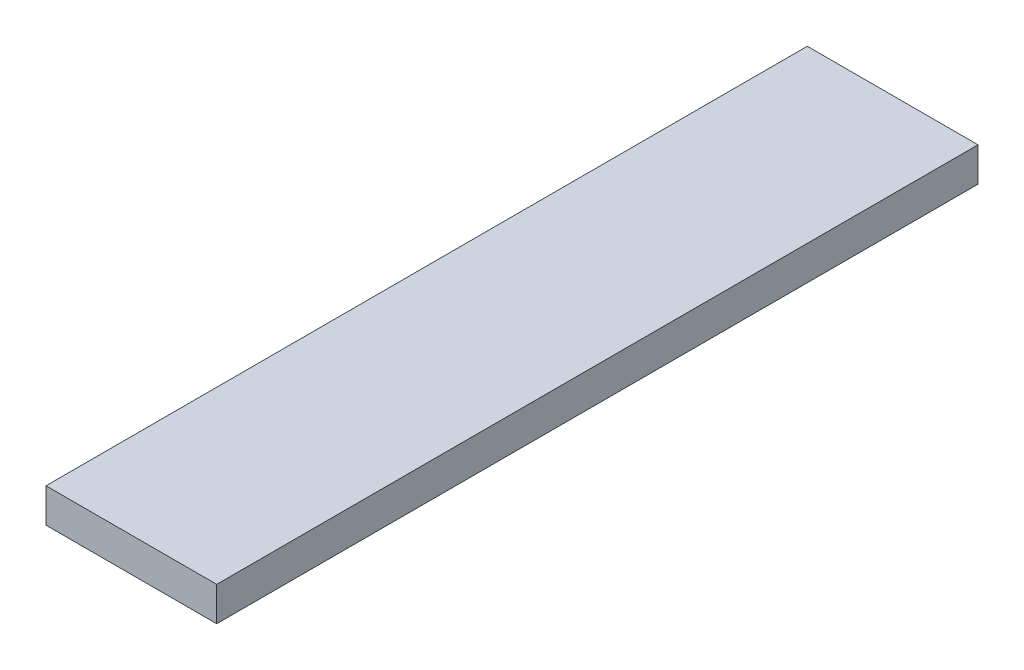
ISO-10303-21;
HEADER;
FILE_DESCRIPTION(('STEP AP214'),'2;1');
FILE_NAME('part.step','',(''),(''),'','','');
FILE_SCHEMA(('AUTOMOTIVE_DESIGN { 1 0 10303 214 1 1 1 1 }'));
ENDSEC;
DATA;
#1=APPLICATION_CONTEXT('core data for automotive mechanical design processes');
#2=APPLICATION_PROTOCOL_DEFINITION('international standard','automotive_design',2000,#1);
#3=PRODUCT_CONTEXT('',#1,'mechanical');
#4=PRODUCT('Part','Part','',(#3));
#5=PRODUCT_RELATED_PRODUCT_CATEGORY('part','',(#4));
#6=PRODUCT_DEFINITION_FORMATION('','',#4);
#7=PRODUCT_DEFINITION_CONTEXT('part definition',#1,'design');
#8=PRODUCT_DEFINITION('design','',#6,#7);
#9=PRODUCT_DEFINITION_SHAPE('','',#8);
#10=(LENGTH_UNIT() NAMED_UNIT(*) SI_UNIT(.MILLI.,.METRE.));
#11=(NAMED_UNIT(*) PLANE_ANGLE_UNIT() SI_UNIT($,.RADIAN.));
#12=(NAMED_UNIT(*) SI_UNIT($,.STERADIAN.) SOLID_ANGLE_UNIT());
#13=UNCERTAINTY_MEASURE_WITH_UNIT(LENGTH_MEASURE(1.E-05),#10,'distance_accuracy_value','');
#14=(GEOMETRIC_REPRESENTATION_CONTEXT(3) GLOBAL_UNCERTAINTY_ASSIGNED_CONTEXT((#13)) GLOBAL_UNIT_ASSIGNED_CONTEXT((#10,
#11,#12)) REPRESENTATION_CONTEXT('',''));
#15=CARTESIAN_POINT('',(0.,0.,0.));
#16=DIRECTION('',(0.,0.,1.));
#17=DIRECTION('',(1.,0.,0.));
#18=AXIS2_PLACEMENT_3D('',#15,#16,#17);
#19=CARTESIAN_POINT('',(0.,10.,0.));
#20=DIRECTION('',(0.,1.,0.));
#21=DIRECTION('',(0.,0.,1.));
#22=AXIS2_PLACEMENT_3D('',#19,#20,#21);
#23=PLANE('',#22);
#24=DIRECTION('',(-1.,0.,0.));
#25=VECTOR('',#24,1.);
#26=CARTESIAN_POINT('',(25.,10.,-111.5));
#27=LINE('',#26,#25);
#28=CARTESIAN_POINT('',(-25.,10.,-111.5));
#29=VERTEX_POINT('',#28);
#30=CARTESIAN_POINT('',(25.,10.,-111.5));
#31=VERTEX_POINT('',#30);
#32=EDGE_CURVE('E68',#29,#31,#27,.F.);
#33=ORIENTED_EDGE('',*,*,#32,.F.);
#34=DIRECTION('',(0.,0.,1.));
#35=VECTOR('',#34,1.);
#36=CARTESIAN_POINT('',(-25.,10.,-111.5));
#37=LINE('',#36,#35);
#38=CARTESIAN_POINT('',(-25.,10.,111.5));
#39=VERTEX_POINT('',#38);
#40=EDGE_CURVE('E20',#39,#29,#37,.F.);
#41=ORIENTED_EDGE('',*,*,#40,.F.);
#42=DIRECTION('',(1.,0.,0.));
#43=VECTOR('',#42,1.);
#44=CARTESIAN_POINT('',(-25.,10.,111.5));
#45=LINE('',#44,#43);
#46=CARTESIAN_POINT('',(25.,10.,111.5));
#47=VERTEX_POINT('',#46);
#48=EDGE_CURVE('E58',#47,#39,#45,.F.);
#49=ORIENTED_EDGE('',*,*,#48,.F.);
#50=DIRECTION('',(0.,0.,-1.));
#51=VECTOR('',#50,1.);
#52=CARTESIAN_POINT('',(25.,10.,111.5));
#53=LINE('',#52,#51);
#54=EDGE_CURVE('E53',#31,#47,#53,.F.);
#55=ORIENTED_EDGE('',*,*,#54,.F.);
#56=EDGE_LOOP('',(#33,#41,#49,#55));
#57=FACE_BOUND('',#56,.T.);
#58=ADVANCED_FACE('F17',(#57),#23,.T.);
#59=CARTESIAN_POINT('',(-25.,0.,-111.5));
#60=DIRECTION('',(-1.,0.,0.));
#61=DIRECTION('',(0.,0.,1.));
#62=AXIS2_PLACEMENT_3D('',#59,#60,#61);
#63=PLANE('',#62);
#64=DIRECTION('',(0.,1.,0.));
#65=VECTOR('',#64,1.);
#66=CARTESIAN_POINT('',(-25.,0.,-111.5));
#67=LINE('',#66,#65);
#68=CARTESIAN_POINT('',(-25.,0.,-111.5));
#69=VERTEX_POINT('',#68);
#70=EDGE_CURVE('E79',#69,#29,#67,.T.);
#71=ORIENTED_EDGE('',*,*,#70,.F.);
#72=DIRECTION('',(0.,0.,1.));
#73=VECTOR('',#72,1.);
#74=CARTESIAN_POINT('',(-25.,0.,0.));
#75=LINE('',#74,#73);
#76=CARTESIAN_POINT('',(-25.,0.,111.5));
#77=VERTEX_POINT('',#76);
#78=EDGE_CURVE('E74',#69,#77,#75,.T.);
#79=ORIENTED_EDGE('',*,*,#78,.T.);
#80=DIRECTION('',(0.,1.,0.));
#81=VECTOR('',#80,1.);
#82=CARTESIAN_POINT('',(-25.,0.,111.5));
#83=LINE('',#82,#81);
#84=EDGE_CURVE('E63',#39,#77,#83,.F.);
#85=ORIENTED_EDGE('',*,*,#84,.F.);
#86=ORIENTED_EDGE('',*,*,#40,.T.);
#87=EDGE_LOOP('',(#71,#79,#85,#86));
#88=FACE_BOUND('',#87,.T.);
#89=ADVANCED_FACE('F73',(#88),#63,.T.);
#90=CARTESIAN_POINT('',(-25.,0.,111.5));
#91=DIRECTION('',(0.,0.,1.));
#92=DIRECTION('',(1.,0.,0.));
#93=AXIS2_PLACEMENT_3D('',#90,#91,#92);
#94=PLANE('',#93);
#95=ORIENTED_EDGE('',*,*,#84,.T.);
#96=DIRECTION('',(1.,0.,0.));
#97=VECTOR('',#96,1.);
#98=CARTESIAN_POINT('',(0.,0.,111.5));
#99=LINE('',#98,#97);
#100=CARTESIAN_POINT('',(25.,0.,111.5));
#101=VERTEX_POINT('',#100);
#102=EDGE_CURVE('E84',#77,#101,#99,.T.);
#103=ORIENTED_EDGE('',*,*,#102,.T.);
#104=DIRECTION('',(0.,1.,0.));
#105=VECTOR('',#104,1.);
#106=CARTESIAN_POINT('',(25.,0.,111.5));
#107=LINE('',#106,#105);
#108=EDGE_CURVE('E65',#47,#101,#107,.F.);
#109=ORIENTED_EDGE('',*,*,#108,.F.);
#110=ORIENTED_EDGE('',*,*,#48,.T.);
#111=EDGE_LOOP('',(#95,#103,#109,#110));
#112=FACE_BOUND('',#111,.T.);
#113=ADVANCED_FACE('F60',(#112),#94,.T.);
#114=CARTESIAN_POINT('',(25.,0.,111.5));
#115=DIRECTION('',(1.,0.,0.));
#116=DIRECTION('',(0.,0.,-1.));
#117=AXIS2_PLACEMENT_3D('',#114,#115,#116);
#118=PLANE('',#117);
#119=ORIENTED_EDGE('',*,*,#108,.T.);
#120=DIRECTION('',(0.,0.,1.));
#121=VECTOR('',#120,1.);
#122=CARTESIAN_POINT('',(25.,0.,0.));
#123=LINE('',#122,#121);
#124=CARTESIAN_POINT('',(25.,0.,-111.5));
#125=VERTEX_POINT('',#124);
#126=EDGE_CURVE('E26',#101,#125,#123,.F.);
#127=ORIENTED_EDGE('',*,*,#126,.T.);
#128=DIRECTION('',(0.,1.,0.));
#129=VECTOR('',#128,1.);
#130=CARTESIAN_POINT('',(25.,0.,-111.5));
#131=LINE('',#130,#129);
#132=EDGE_CURVE('E34',#31,#125,#131,.F.);
#133=ORIENTED_EDGE('',*,*,#132,.F.);
#134=ORIENTED_EDGE('',*,*,#54,.T.);
#135=EDGE_LOOP('',(#119,#127,#133,#134));
#136=FACE_BOUND('',#135,.T.);
#137=ADVANCED_FACE('F88',(#136),#118,.T.);
#138=CARTESIAN_POINT('',(25.,0.,-111.5));
#139=DIRECTION('',(0.,0.,-1.));
#140=DIRECTION('',(-1.,0.,0.));
#141=AXIS2_PLACEMENT_3D('',#138,#139,#140);
#142=PLANE('',#141);
#143=ORIENTED_EDGE('',*,*,#132,.T.);
#144=DIRECTION('',(1.,0.,0.));
#145=VECTOR('',#144,1.);
#146=CARTESIAN_POINT('',(0.,0.,-111.5));
#147=LINE('',#146,#145);
#148=EDGE_CURVE('E11',#125,#69,#147,.F.);
#149=ORIENTED_EDGE('',*,*,#148,.T.);
#150=ORIENTED_EDGE('',*,*,#70,.T.);
#151=ORIENTED_EDGE('',*,*,#32,.T.);
#152=EDGE_LOOP('',(#143,#149,#150,#151));
#153=FACE_BOUND('',#152,.T.);
#154=ADVANCED_FACE('F91',(#153),#142,.T.);
#155=CARTESIAN_POINT('',(0.,0.,0.));
#156=DIRECTION('',(0.,1.,0.));
#157=DIRECTION('',(0.,0.,1.));
#158=AXIS2_PLACEMENT_3D('',#155,#156,#157);
#159=PLANE('',#158);
#160=ORIENTED_EDGE('',*,*,#126,.F.);
#161=ORIENTED_EDGE('',*,*,#102,.F.);
#162=ORIENTED_EDGE('',*,*,#78,.F.);
#163=ORIENTED_EDGE('',*,*,#148,.F.);
#164=EDGE_LOOP('',(#160,#161,#162,#163));
#165=FACE_BOUND('',#164,.T.);
#166=ADVANCED_FACE('F90',(#165),#159,.F.);
#167=CLOSED_SHELL('',(#58,#89,#113,#137,#154,#166));
#168=MANIFOLD_SOLID_BREP('B1',#167);
#169=ADVANCED_BREP_SHAPE_REPRESENTATION('',(#18,#168),#14);
#170=SHAPE_DEFINITION_REPRESENTATION(#9,#169);
ENDSEC;
END-ISO-10303-21;
